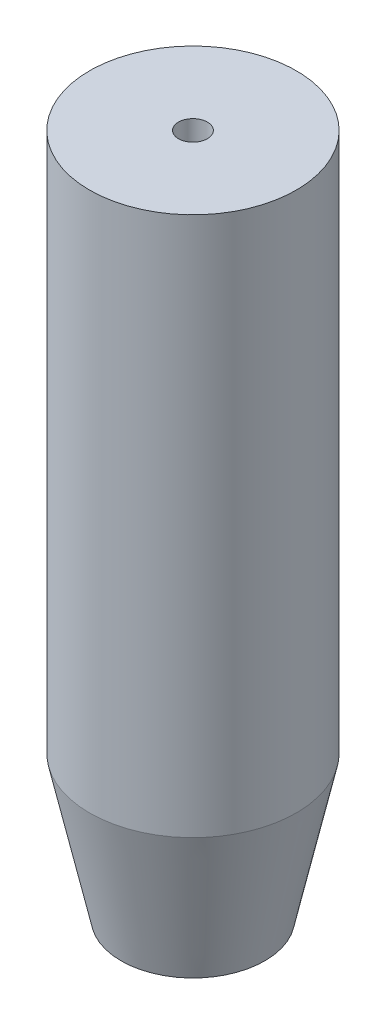
ISO-10303-21;
HEADER;
FILE_DESCRIPTION(('STEP AP214'),'2;1');
FILE_NAME('part.step','',(''),(''),'','','');
FILE_SCHEMA(('AUTOMOTIVE_DESIGN { 1 0 10303 214 1 1 1 1 }'));
ENDSEC;
DATA;
#1=APPLICATION_CONTEXT('core data for automotive mechanical design processes');
#2=APPLICATION_PROTOCOL_DEFINITION('international standard','automotive_design',2000,#1);
#3=PRODUCT_CONTEXT('',#1,'mechanical');
#4=PRODUCT('Part','Part','',(#3));
#5=PRODUCT_RELATED_PRODUCT_CATEGORY('part','',(#4));
#6=PRODUCT_DEFINITION_FORMATION('','',#4);
#7=PRODUCT_DEFINITION_CONTEXT('part definition',#1,'design');
#8=PRODUCT_DEFINITION('design','',#6,#7);
#9=PRODUCT_DEFINITION_SHAPE('','',#8);
#10=(LENGTH_UNIT() NAMED_UNIT(*) SI_UNIT(.MILLI.,.METRE.));
#11=(NAMED_UNIT(*) PLANE_ANGLE_UNIT() SI_UNIT($,.RADIAN.));
#12=(NAMED_UNIT(*) SI_UNIT($,.STERADIAN.) SOLID_ANGLE_UNIT());
#13=UNCERTAINTY_MEASURE_WITH_UNIT(LENGTH_MEASURE(1.E-05),#10,'distance_accuracy_value','');
#14=(GEOMETRIC_REPRESENTATION_CONTEXT(3) GLOBAL_UNCERTAINTY_ASSIGNED_CONTEXT((#13)) GLOBAL_UNIT_ASSIGNED_CONTEXT((#10,
#11,#12)) REPRESENTATION_CONTEXT('',''));
#15=CARTESIAN_POINT('',(0.,0.,0.));
#16=DIRECTION('',(0.,0.,1.));
#17=DIRECTION('',(1.,0.,0.));
#18=AXIS2_PLACEMENT_3D('',#15,#16,#17);
#19=CARTESIAN_POINT('',(0.,120.65,0.));
#20=DIRECTION('',(0.,-1.,0.));
#21=DIRECTION('',(0.,0.,-1.));
#22=AXIS2_PLACEMENT_3D('',#19,#20,#21);
#23=CYLINDRICAL_SURFACE('',#22,18.25625);
#24=CARTESIAN_POINT('',(0.,25.4000000000012,0.));
#25=DIRECTION('',(0.,1.,0.));
#26=DIRECTION('',(0.,0.,1.));
#27=AXIS2_PLACEMENT_3D('',#24,#25,#26);
#28=CIRCLE('',#27,18.25625);
#29=CARTESIAN_POINT('',(0.,25.4000000000012,18.25625));
#30=VERTEX_POINT('',#29);
#31=EDGE_CURVE('E57',#30,#30,#28,.T.);
#32=ORIENTED_EDGE('',*,*,#31,.T.);
#33=EDGE_LOOP('',(#32));
#34=FACE_BOUND('',#33,.T.);
#35=CARTESIAN_POINT('',(0.,120.65,0.));
#36=DIRECTION('',(0.,1.,0.));
#37=DIRECTION('',(0.,0.,1.));
#38=AXIS2_PLACEMENT_3D('',#35,#36,#37);
#39=CIRCLE('',#38,18.25625);
#40=CARTESIAN_POINT('',(0.,120.65,18.25625));
#41=VERTEX_POINT('',#40);
#42=EDGE_CURVE('E69',#41,#41,#39,.T.);
#43=ORIENTED_EDGE('',*,*,#42,.F.);
#44=EDGE_LOOP('',(#43));
#45=FACE_BOUND('',#44,.T.);
#46=ADVANCED_FACE('F50',(#34,#45),#23,.T.);
#47=CARTESIAN_POINT('',(0.,120.65,0.));
#48=DIRECTION('',(0.,1.,0.));
#49=DIRECTION('',(0.,0.,1.));
#50=AXIS2_PLACEMENT_3D('',#47,#48,#49);
#51=PLANE('',#50);
#52=CARTESIAN_POINT('',(0.,120.65,0.));
#53=DIRECTION('',(0.,1.,0.));
#54=DIRECTION('',(0.,0.,1.));
#55=AXIS2_PLACEMENT_3D('',#52,#53,#54);
#56=CIRCLE('',#55,2.55269999999999);
#57=CARTESIAN_POINT('',(0.,120.65,2.55269999999999));
#58=VERTEX_POINT('',#57);
#59=EDGE_CURVE('E70',#58,#58,#56,.T.);
#60=ORIENTED_EDGE('',*,*,#59,.F.);
#61=EDGE_LOOP('',(#60));
#62=FACE_BOUND('',#61,.T.);
#63=ORIENTED_EDGE('',*,*,#42,.T.);
#64=EDGE_LOOP('',(#63));
#65=FACE_BOUND('',#64,.T.);
#66=ADVANCED_FACE('F87',(#62,#65),#51,.T.);
#67=CARTESIAN_POINT('',(0.,0.,0.));
#68=DIRECTION('',(0.,1.,0.));
#69=DIRECTION('',(0.,0.,1.));
#70=AXIS2_PLACEMENT_3D('',#67,#68,#69);
#71=PLANE('',#70);
#72=CARTESIAN_POINT('',(0.,0.,0.));
#73=DIRECTION('',(0.,1.,0.));
#74=DIRECTION('',(0.,0.,1.));
#75=AXIS2_PLACEMENT_3D('',#72,#73,#74);
#76=CIRCLE('',#75,12.6999999999998);
#77=CARTESIAN_POINT('',(0.,0.,12.6999999999998));
#78=VERTEX_POINT('',#77);
#79=EDGE_CURVE('E13',#78,#78,#76,.F.);
#80=ORIENTED_EDGE('',*,*,#79,.T.);
#81=EDGE_LOOP('',(#80));
#82=FACE_BOUND('',#81,.T.);
#83=ADVANCED_FACE('F82',(#82),#71,.F.);
#84=CARTESIAN_POINT('',(0.,25.4000000000012,0.));
#85=DIRECTION('',(0.,1.,0.));
#86=DIRECTION('',(0.,0.,1.));
#87=AXIS2_PLACEMENT_3D('',#84,#85,#86);
#88=CONICAL_SURFACE('',#87,18.25625,0.215357699697737);
#89=ORIENTED_EDGE('',*,*,#79,.F.);
#90=EDGE_LOOP('',(#89));
#91=FACE_BOUND('',#90,.T.);
#92=ORIENTED_EDGE('',*,*,#31,.F.);
#93=EDGE_LOOP('',(#92));
#94=FACE_BOUND('',#93,.T.);
#95=ADVANCED_FACE('F52',(#91,#94),#88,.T.);
#96=CARTESIAN_POINT('',(0.,104.14,0.));
#97=DIRECTION('',(0.,1.,0.));
#98=DIRECTION('',(0.,0.,1.));
#99=AXIS2_PLACEMENT_3D('',#96,#97,#98);
#100=CONICAL_SURFACE('',#99,2.55269999999999,1.02974425867665);
#101=CARTESIAN_POINT('',(0.,102.606183097808,0.));
#102=VERTEX_POINT('',#101);
#103=VERTEX_LOOP('',#102);
#104=FACE_BOUND('',#103,.T.);
#105=CARTESIAN_POINT('',(0.,104.14,0.));
#106=DIRECTION('',(0.,1.,0.));
#107=DIRECTION('',(0.,0.,1.));
#108=AXIS2_PLACEMENT_3D('',#105,#106,#107);
#109=CIRCLE('',#108,2.55269999999999);
#110=CARTESIAN_POINT('',(0.,104.14,2.55269999999999));
#111=VERTEX_POINT('',#110);
#112=EDGE_CURVE('E67',#111,#111,#109,.T.);
#113=ORIENTED_EDGE('',*,*,#112,.T.);
#114=EDGE_LOOP('',(#113));
#115=FACE_BOUND('',#114,.T.);
#116=ADVANCED_FACE('F60',(#104,#115),#100,.F.);
#117=CARTESIAN_POINT('',(0.,120.65,0.));
#118=DIRECTION('',(0.,1.,0.));
#119=DIRECTION('',(0.,0.,1.));
#120=AXIS2_PLACEMENT_3D('',#117,#118,#119);
#121=CYLINDRICAL_SURFACE('',#120,2.55269999999999);
#122=ORIENTED_EDGE('',*,*,#112,.F.);
#123=EDGE_LOOP('',(#122));
#124=FACE_BOUND('',#123,.T.);
#125=ORIENTED_EDGE('',*,*,#59,.T.);
#126=EDGE_LOOP('',(#125));
#127=FACE_BOUND('',#126,.T.);
#128=ADVANCED_FACE('F63',(#124,#127),#121,.F.);
#129=CLOSED_SHELL('',(#46,#66,#83,#95,#116,#128));
#130=MANIFOLD_SOLID_BREP('B2',#129);
#131=ADVANCED_BREP_SHAPE_REPRESENTATION('',(#18,#130),#14);
#132=SHAPE_DEFINITION_REPRESENTATION(#9,#131);
ENDSEC;
END-ISO-10303-21;
